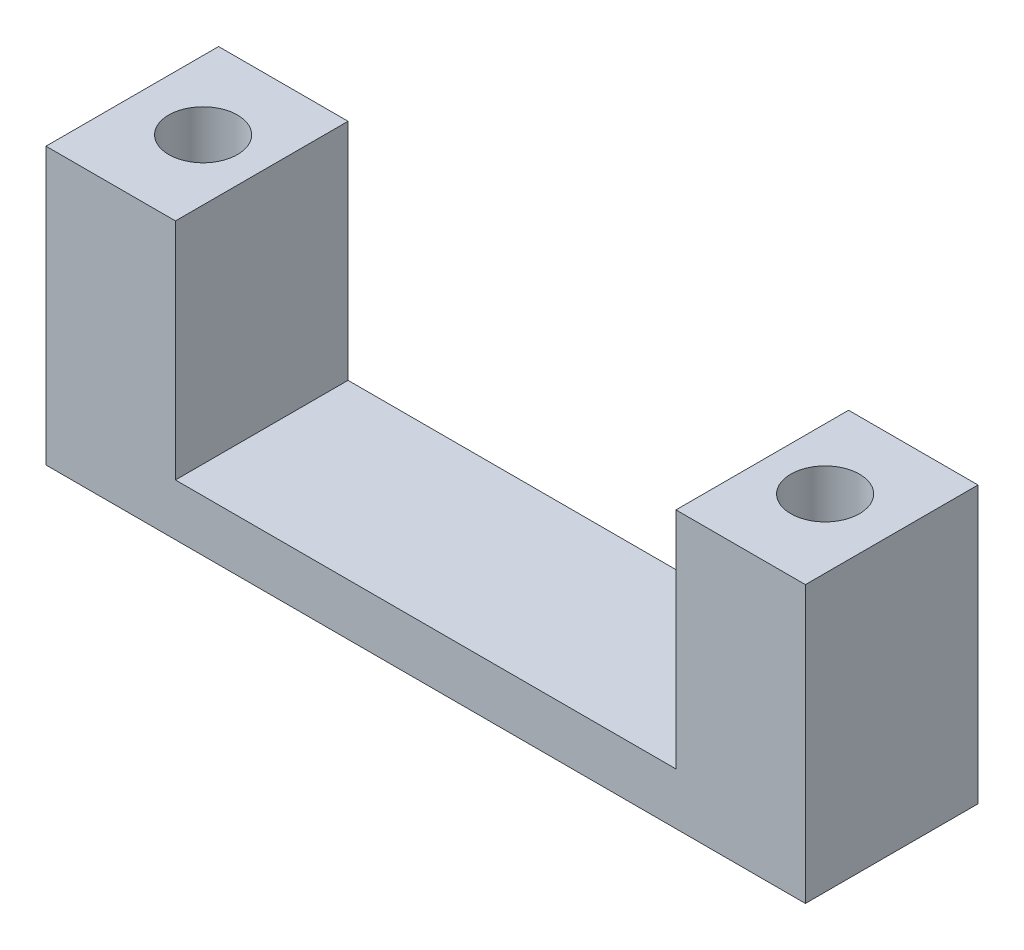
ISO-10303-21;
HEADER;
FILE_DESCRIPTION(('STEP AP214'),'2;1');
FILE_NAME('part.step','',(''),(''),'','','');
FILE_SCHEMA(('AUTOMOTIVE_DESIGN { 1 0 10303 214 1 1 1 1 }'));
ENDSEC;
DATA;
#1=APPLICATION_CONTEXT('core data for automotive mechanical design processes');
#2=APPLICATION_PROTOCOL_DEFINITION('international standard','automotive_design',2000,#1);
#3=PRODUCT_CONTEXT('',#1,'mechanical');
#4=PRODUCT('Part','Part','',(#3));
#5=PRODUCT_RELATED_PRODUCT_CATEGORY('part','',(#4));
#6=PRODUCT_DEFINITION_FORMATION('','',#4);
#7=PRODUCT_DEFINITION_CONTEXT('part definition',#1,'design');
#8=PRODUCT_DEFINITION('design','',#6,#7);
#9=PRODUCT_DEFINITION_SHAPE('','',#8);
#10=(LENGTH_UNIT() NAMED_UNIT(*) SI_UNIT(.MILLI.,.METRE.));
#11=(NAMED_UNIT(*) PLANE_ANGLE_UNIT() SI_UNIT($,.RADIAN.));
#12=(NAMED_UNIT(*) SI_UNIT($,.STERADIAN.) SOLID_ANGLE_UNIT());
#13=UNCERTAINTY_MEASURE_WITH_UNIT(LENGTH_MEASURE(1.E-05),#10,'distance_accuracy_value','');
#14=(GEOMETRIC_REPRESENTATION_CONTEXT(3) GLOBAL_UNCERTAINTY_ASSIGNED_CONTEXT((#13)) GLOBAL_UNIT_ASSIGNED_CONTEXT((#10,
#11,#12)) REPRESENTATION_CONTEXT('',''));
#15=CARTESIAN_POINT('',(0.,0.,0.));
#16=DIRECTION('',(0.,0.,1.));
#17=DIRECTION('',(1.,0.,0.));
#18=AXIS2_PLACEMENT_3D('',#15,#16,#17);
#19=CARTESIAN_POINT('',(0.,3.81,0.));
#20=DIRECTION('',(0.,1.,0.));
#21=DIRECTION('',(0.,0.,1.));
#22=AXIS2_PLACEMENT_3D('',#19,#20,#21);
#23=PLANE('',#22);
#24=DIRECTION('',(1.,0.,0.));
#25=VECTOR('',#24,1.);
#26=CARTESIAN_POINT('',(0.,3.81,0.));
#27=LINE('',#26,#25);
#28=CARTESIAN_POINT('',(-46.355,3.81,0.));
#29=VERTEX_POINT('',#28);
#30=CARTESIAN_POINT('',(-9.52500000000001,3.81,0.));
#31=VERTEX_POINT('',#30);
#32=EDGE_CURVE('E63',#29,#31,#27,.T.);
#33=ORIENTED_EDGE('',*,*,#32,.T.);
#34=DIRECTION('',(0.,0.,1.));
#35=VECTOR('',#34,1.);
#36=CARTESIAN_POINT('',(-9.52500000000001,3.81,-12.7));
#37=LINE('',#36,#35);
#38=CARTESIAN_POINT('',(-9.52500000000001,3.81,-12.7));
#39=VERTEX_POINT('',#38);
#40=EDGE_CURVE('E58',#39,#31,#37,.T.);
#41=ORIENTED_EDGE('',*,*,#40,.F.);
#42=DIRECTION('',(-1.,0.,0.));
#43=VECTOR('',#42,1.);
#44=CARTESIAN_POINT('',(0.,3.81,-12.7));
#45=LINE('',#44,#43);
#46=CARTESIAN_POINT('',(-46.355,3.81,-12.7));
#47=VERTEX_POINT('',#46);
#48=EDGE_CURVE('E186',#39,#47,#45,.T.);
#49=ORIENTED_EDGE('',*,*,#48,.T.);
#50=DIRECTION('',(0.,0.,-1.));
#51=VECTOR('',#50,1.);
#52=CARTESIAN_POINT('',(-46.355,3.81,-12.7));
#53=LINE('',#52,#51);
#54=EDGE_CURVE('E146',#29,#47,#53,.T.);
#55=ORIENTED_EDGE('',*,*,#54,.F.);
#56=EDGE_LOOP('',(#33,#41,#49,#55));
#57=FACE_BOUND('',#56,.T.);
#58=ADVANCED_FACE('F42',(#57),#23,.T.);
#59=CARTESIAN_POINT('',(0.,3.81,0.));
#60=DIRECTION('',(-1.,0.,0.));
#61=DIRECTION('',(0.,0.,1.));
#62=AXIS2_PLACEMENT_3D('',#59,#60,#61);
#63=PLANE('',#62);
#64=DIRECTION('',(0.,0.,-1.));
#65=VECTOR('',#64,1.);
#66=CARTESIAN_POINT('',(0.,0.,0.));
#67=LINE('',#66,#65);
#68=CARTESIAN_POINT('',(0.,0.,0.));
#69=VERTEX_POINT('',#68);
#70=CARTESIAN_POINT('',(0.,0.,-12.7));
#71=VERTEX_POINT('',#70);
#72=EDGE_CURVE('E185',#69,#71,#67,.T.);
#73=ORIENTED_EDGE('',*,*,#72,.T.);
#74=DIRECTION('',(0.,-1.,0.));
#75=VECTOR('',#74,1.);
#76=CARTESIAN_POINT('',(0.,3.81,-12.7));
#77=LINE('',#76,#75);
#78=CARTESIAN_POINT('',(0.,20.32,-12.7));
#79=VERTEX_POINT('',#78);
#80=EDGE_CURVE('E11',#79,#71,#77,.T.);
#81=ORIENTED_EDGE('',*,*,#80,.F.);
#82=DIRECTION('',(0.,0.,-1.));
#83=VECTOR('',#82,1.);
#84=CARTESIAN_POINT('',(0.,20.32,-12.7));
#85=LINE('',#84,#83);
#86=CARTESIAN_POINT('',(0.,20.32,0.));
#87=VERTEX_POINT('',#86);
#88=EDGE_CURVE('E147',#87,#79,#85,.T.);
#89=ORIENTED_EDGE('',*,*,#88,.F.);
#90=DIRECTION('',(0.,-1.,0.));
#91=VECTOR('',#90,1.);
#92=CARTESIAN_POINT('',(0.,3.81,0.));
#93=LINE('',#92,#91);
#94=EDGE_CURVE('E192',#87,#69,#93,.T.);
#95=ORIENTED_EDGE('',*,*,#94,.T.);
#96=EDGE_LOOP('',(#73,#81,#89,#95));
#97=FACE_BOUND('',#96,.T.);
#98=ADVANCED_FACE('F44',(#97),#63,.F.);
#99=CARTESIAN_POINT('',(0.,3.81,-12.7));
#100=DIRECTION('',(0.,0.,1.));
#101=DIRECTION('',(1.,0.,0.));
#102=AXIS2_PLACEMENT_3D('',#99,#100,#101);
#103=PLANE('',#102);
#104=DIRECTION('',(-1.,0.,0.));
#105=VECTOR('',#104,1.);
#106=CARTESIAN_POINT('',(0.,0.,-12.7));
#107=LINE('',#106,#105);
#108=CARTESIAN_POINT('',(-55.88,0.,-12.7));
#109=VERTEX_POINT('',#108);
#110=EDGE_CURVE('E196',#71,#109,#107,.T.);
#111=ORIENTED_EDGE('',*,*,#110,.T.);
#112=DIRECTION('',(0.,-1.,0.));
#113=VECTOR('',#112,1.);
#114=CARTESIAN_POINT('',(-55.88,3.81,-12.7));
#115=LINE('',#114,#113);
#116=CARTESIAN_POINT('',(-55.88,20.32,-12.7));
#117=VERTEX_POINT('',#116);
#118=EDGE_CURVE('E51',#117,#109,#115,.T.);
#119=ORIENTED_EDGE('',*,*,#118,.F.);
#120=DIRECTION('',(-1.,0.,0.));
#121=VECTOR('',#120,1.);
#122=CARTESIAN_POINT('',(-55.88,20.32,-12.7));
#123=LINE('',#122,#121);
#124=CARTESIAN_POINT('',(-46.355,20.32,-12.7));
#125=VERTEX_POINT('',#124);
#126=EDGE_CURVE('E170',#125,#117,#123,.T.);
#127=ORIENTED_EDGE('',*,*,#126,.F.);
#128=DIRECTION('',(0.,-1.,0.));
#129=VECTOR('',#128,1.);
#130=CARTESIAN_POINT('',(-46.355,20.32,-12.7));
#131=LINE('',#130,#129);
#132=EDGE_CURVE('E174',#125,#47,#131,.T.);
#133=ORIENTED_EDGE('',*,*,#132,.T.);
#134=ORIENTED_EDGE('',*,*,#48,.F.);
#135=DIRECTION('',(0.,-1.,0.));
#136=VECTOR('',#135,1.);
#137=CARTESIAN_POINT('',(-9.52500000000001,20.32,-12.7));
#138=LINE('',#137,#136);
#139=CARTESIAN_POINT('',(-9.52500000000001,20.32,-12.7));
#140=VERTEX_POINT('',#139);
#141=EDGE_CURVE('E135',#140,#39,#138,.T.);
#142=ORIENTED_EDGE('',*,*,#141,.F.);
#143=DIRECTION('',(-1.,0.,0.));
#144=VECTOR('',#143,1.);
#145=CARTESIAN_POINT('',(0.,20.32,-12.7));
#146=LINE('',#145,#144);
#147=EDGE_CURVE('E154',#79,#140,#146,.T.);
#148=ORIENTED_EDGE('',*,*,#147,.F.);
#149=ORIENTED_EDGE('',*,*,#80,.T.);
#150=EDGE_LOOP('',(#111,#119,#127,#133,#134,#142,#148,#149));
#151=FACE_BOUND('',#150,.T.);
#152=ADVANCED_FACE('F237',(#151),#103,.F.);
#153=CARTESIAN_POINT('',(-55.88,3.81,0.));
#154=DIRECTION('',(1.,0.,0.));
#155=DIRECTION('',(0.,0.,-1.));
#156=AXIS2_PLACEMENT_3D('',#153,#154,#155);
#157=PLANE('',#156);
#158=DIRECTION('',(0.,0.,1.));
#159=VECTOR('',#158,1.);
#160=CARTESIAN_POINT('',(-55.88,0.,0.));
#161=LINE('',#160,#159);
#162=CARTESIAN_POINT('',(-55.88,0.,0.));
#163=VERTEX_POINT('',#162);
#164=EDGE_CURVE('E199',#109,#163,#161,.T.);
#165=ORIENTED_EDGE('',*,*,#164,.T.);
#166=DIRECTION('',(0.,-1.,0.));
#167=VECTOR('',#166,1.);
#168=CARTESIAN_POINT('',(-55.88,3.81,0.));
#169=LINE('',#168,#167);
#170=CARTESIAN_POINT('',(-55.88,20.32,0.));
#171=VERTEX_POINT('',#170);
#172=EDGE_CURVE('E207',#171,#163,#169,.T.);
#173=ORIENTED_EDGE('',*,*,#172,.F.);
#174=DIRECTION('',(0.,0.,1.));
#175=VECTOR('',#174,1.);
#176=CARTESIAN_POINT('',(-55.88,20.32,-12.7));
#177=LINE('',#176,#175);
#178=EDGE_CURVE('E160',#117,#171,#177,.T.);
#179=ORIENTED_EDGE('',*,*,#178,.F.);
#180=ORIENTED_EDGE('',*,*,#118,.T.);
#181=EDGE_LOOP('',(#165,#173,#179,#180));
#182=FACE_BOUND('',#181,.T.);
#183=ADVANCED_FACE('F215',(#182),#157,.F.);
#184=CARTESIAN_POINT('',(0.,3.81,0.));
#185=DIRECTION('',(0.,0.,-1.));
#186=DIRECTION('',(-1.,0.,0.));
#187=AXIS2_PLACEMENT_3D('',#184,#185,#186);
#188=PLANE('',#187);
#189=DIRECTION('',(1.,0.,0.));
#190=VECTOR('',#189,1.);
#191=CARTESIAN_POINT('',(0.,0.,0.));
#192=LINE('',#191,#190);
#193=EDGE_CURVE('E189',#163,#69,#192,.T.);
#194=ORIENTED_EDGE('',*,*,#193,.T.);
#195=ORIENTED_EDGE('',*,*,#94,.F.);
#196=DIRECTION('',(1.,0.,0.));
#197=VECTOR('',#196,1.);
#198=CARTESIAN_POINT('',(0.,20.32,0.));
#199=LINE('',#198,#197);
#200=CARTESIAN_POINT('',(-9.52500000000001,20.32,0.));
#201=VERTEX_POINT('',#200);
#202=EDGE_CURVE('E143',#201,#87,#199,.T.);
#203=ORIENTED_EDGE('',*,*,#202,.F.);
#204=DIRECTION('',(0.,-1.,0.));
#205=VECTOR('',#204,1.);
#206=CARTESIAN_POINT('',(-9.52500000000001,20.32,0.));
#207=LINE('',#206,#205);
#208=EDGE_CURVE('E139',#201,#31,#207,.T.);
#209=ORIENTED_EDGE('',*,*,#208,.T.);
#210=ORIENTED_EDGE('',*,*,#32,.F.);
#211=DIRECTION('',(0.,-1.,0.));
#212=VECTOR('',#211,1.);
#213=CARTESIAN_POINT('',(-46.355,20.32,0.));
#214=LINE('',#213,#212);
#215=CARTESIAN_POINT('',(-46.355,20.32,0.));
#216=VERTEX_POINT('',#215);
#217=EDGE_CURVE('E181',#216,#29,#214,.T.);
#218=ORIENTED_EDGE('',*,*,#217,.F.);
#219=DIRECTION('',(1.,0.,0.));
#220=VECTOR('',#219,1.);
#221=CARTESIAN_POINT('',(-55.88,20.32,0.));
#222=LINE('',#221,#220);
#223=EDGE_CURVE('E164',#171,#216,#222,.T.);
#224=ORIENTED_EDGE('',*,*,#223,.F.);
#225=ORIENTED_EDGE('',*,*,#172,.T.);
#226=EDGE_LOOP('',(#194,#195,#203,#209,#210,#218,#224,#225));
#227=FACE_BOUND('',#226,.T.);
#228=ADVANCED_FACE('F223',(#227),#188,.F.);
#229=CARTESIAN_POINT('',(0.,0.,0.));
#230=DIRECTION('',(0.,1.,0.));
#231=DIRECTION('',(0.,0.,1.));
#232=AXIS2_PLACEMENT_3D('',#229,#230,#231);
#233=PLANE('',#232);
#234=ORIENTED_EDGE('',*,*,#72,.F.);
#235=ORIENTED_EDGE('',*,*,#193,.F.);
#236=ORIENTED_EDGE('',*,*,#164,.F.);
#237=ORIENTED_EDGE('',*,*,#110,.F.);
#238=EDGE_LOOP('',(#234,#235,#236,#237));
#239=FACE_BOUND('',#238,.T.);
#240=ADVANCED_FACE('F221',(#239),#233,.F.);
#241=CARTESIAN_POINT('',(-46.355,20.32,-12.7));
#242=DIRECTION('',(-1.,0.,0.));
#243=DIRECTION('',(0.,0.,1.));
#244=AXIS2_PLACEMENT_3D('',#241,#242,#243);
#245=PLANE('',#244);
#246=ORIENTED_EDGE('',*,*,#54,.T.);
#247=ORIENTED_EDGE('',*,*,#132,.F.);
#248=DIRECTION('',(0.,0.,-1.));
#249=VECTOR('',#248,1.);
#250=CARTESIAN_POINT('',(-46.355,20.32,-12.7));
#251=LINE('',#250,#249);
#252=EDGE_CURVE('E167',#216,#125,#251,.T.);
#253=ORIENTED_EDGE('',*,*,#252,.F.);
#254=ORIENTED_EDGE('',*,*,#217,.T.);
#255=EDGE_LOOP('',(#246,#247,#253,#254));
#256=FACE_BOUND('',#255,.T.);
#257=ADVANCED_FACE('F240',(#256),#245,.F.);
#258=CARTESIAN_POINT('',(0.,20.32,0.));
#259=DIRECTION('',(0.,1.,0.));
#260=DIRECTION('',(0.,0.,1.));
#261=AXIS2_PLACEMENT_3D('',#258,#259,#260);
#262=PLANE('',#261);
#263=CARTESIAN_POINT('',(-50.8254,20.32,-6.50524861641984));
#264=DIRECTION('',(0.,1.,0.));
#265=DIRECTION('',(0.,0.,1.));
#266=AXIS2_PLACEMENT_3D('',#263,#264,#265);
#267=CIRCLE('',#266,2.52729999999999);
#268=CARTESIAN_POINT('',(-50.8254,20.32,-3.97794861641985));
#269=VERTEX_POINT('',#268);
#270=EDGE_CURVE('E122',#269,#269,#267,.T.);
#271=ORIENTED_EDGE('',*,*,#270,.F.);
#272=EDGE_LOOP('',(#271));
#273=FACE_BOUND('',#272,.T.);
#274=ORIENTED_EDGE('',*,*,#178,.T.);
#275=ORIENTED_EDGE('',*,*,#223,.T.);
#276=ORIENTED_EDGE('',*,*,#252,.T.);
#277=ORIENTED_EDGE('',*,*,#126,.T.);
#278=EDGE_LOOP('',(#274,#275,#276,#277));
#279=FACE_BOUND('',#278,.T.);
#280=ADVANCED_FACE('F243',(#273,#279),#262,.T.);
#281=CARTESIAN_POINT('',(-9.52500000000001,20.32,-12.7));
#282=DIRECTION('',(1.,0.,0.));
#283=DIRECTION('',(0.,0.,-1.));
#284=AXIS2_PLACEMENT_3D('',#281,#282,#283);
#285=PLANE('',#284);
#286=ORIENTED_EDGE('',*,*,#40,.T.);
#287=ORIENTED_EDGE('',*,*,#208,.F.);
#288=DIRECTION('',(0.,0.,1.));
#289=VECTOR('',#288,1.);
#290=CARTESIAN_POINT('',(-9.52500000000001,20.32,-12.7));
#291=LINE('',#290,#289);
#292=EDGE_CURVE('E151',#140,#201,#291,.T.);
#293=ORIENTED_EDGE('',*,*,#292,.F.);
#294=ORIENTED_EDGE('',*,*,#141,.T.);
#295=EDGE_LOOP('',(#286,#287,#293,#294));
#296=FACE_BOUND('',#295,.T.);
#297=ADVANCED_FACE('F236',(#296),#285,.F.);
#298=CARTESIAN_POINT('',(0.,20.32,0.));
#299=DIRECTION('',(0.,-1.,0.));
#300=DIRECTION('',(0.,0.,-1.));
#301=AXIS2_PLACEMENT_3D('',#298,#299,#300);
#302=PLANE('',#301);
#303=CARTESIAN_POINT('',(-5.05460000000001,20.32,-6.50524861641984));
#304=DIRECTION('',(0.,1.,0.));
#305=DIRECTION('',(0.,0.,1.));
#306=AXIS2_PLACEMENT_3D('',#303,#304,#305);
#307=CIRCLE('',#306,2.52729999999999);
#308=CARTESIAN_POINT('',(-5.05460000000001,20.32,-3.97794861641985));
#309=VERTEX_POINT('',#308);
#310=EDGE_CURVE('E121',#309,#309,#307,.T.);
#311=ORIENTED_EDGE('',*,*,#310,.F.);
#312=EDGE_LOOP('',(#311));
#313=FACE_BOUND('',#312,.T.);
#314=ORIENTED_EDGE('',*,*,#88,.T.);
#315=ORIENTED_EDGE('',*,*,#147,.T.);
#316=ORIENTED_EDGE('',*,*,#292,.T.);
#317=ORIENTED_EDGE('',*,*,#202,.T.);
#318=EDGE_LOOP('',(#314,#315,#316,#317));
#319=FACE_BOUND('',#318,.T.);
#320=ADVANCED_FACE('F230',(#313,#319),#302,.F.);
#321=CARTESIAN_POINT('',(-5.05460000000001,13.208,-6.50524861641984));
#322=DIRECTION('',(0.,1.,0.));
#323=DIRECTION('',(0.,0.,1.));
#324=AXIS2_PLACEMENT_3D('',#321,#322,#323);
#325=CONICAL_SURFACE('',#324,2.5273,1.02974425867665);
#326=CARTESIAN_POINT('',(-5.05460000000001,11.6894449575316,-6.50524861641984));
#327=VERTEX_POINT('',#326);
#328=VERTEX_LOOP('',#327);
#329=FACE_BOUND('',#328,.T.);
#330=CARTESIAN_POINT('',(-5.05460000000001,13.208,-6.50524861641984));
#331=DIRECTION('',(0.,1.,0.));
#332=DIRECTION('',(0.,0.,1.));
#333=AXIS2_PLACEMENT_3D('',#330,#331,#332);
#334=CIRCLE('',#333,2.5273);
#335=CARTESIAN_POINT('',(-5.05460000000001,13.208,-3.97794861641984));
#336=VERTEX_POINT('',#335);
#337=EDGE_CURVE('E127',#336,#336,#334,.T.);
#338=ORIENTED_EDGE('',*,*,#337,.T.);
#339=EDGE_LOOP('',(#338));
#340=FACE_BOUND('',#339,.T.);
#341=ADVANCED_FACE('F309',(#329,#340),#325,.F.);
#342=CARTESIAN_POINT('',(-5.05460000000001,20.32,-6.50524861641984));
#343=DIRECTION('',(0.,1.,0.));
#344=DIRECTION('',(0.,0.,1.));
#345=AXIS2_PLACEMENT_3D('',#342,#343,#344);
#346=CYLINDRICAL_SURFACE('',#345,2.52729999999999);
#347=ORIENTED_EDGE('',*,*,#337,.F.);
#348=EDGE_LOOP('',(#347));
#349=FACE_BOUND('',#348,.T.);
#350=ORIENTED_EDGE('',*,*,#310,.T.);
#351=EDGE_LOOP('',(#350));
#352=FACE_BOUND('',#351,.T.);
#353=ADVANCED_FACE('F114',(#349,#352),#346,.F.);
#354=CARTESIAN_POINT('',(-50.8254,13.208,-6.50524861641984));
#355=DIRECTION('',(0.,1.,0.));
#356=DIRECTION('',(0.,0.,1.));
#357=AXIS2_PLACEMENT_3D('',#354,#355,#356);
#358=CONICAL_SURFACE('',#357,2.5273,1.02974425867665);
#359=CARTESIAN_POINT('',(-50.8254,11.6894449575316,-6.50524861641984));
#360=VERTEX_POINT('',#359);
#361=VERTEX_LOOP('',#360);
#362=FACE_BOUND('',#361,.T.);
#363=CARTESIAN_POINT('',(-50.8254,13.208,-6.50524861641984));
#364=DIRECTION('',(0.,1.,0.));
#365=DIRECTION('',(0.,0.,1.));
#366=AXIS2_PLACEMENT_3D('',#363,#364,#365);
#367=CIRCLE('',#366,2.5273);
#368=CARTESIAN_POINT('',(-50.8254,13.208,-3.97794861641984));
#369=VERTEX_POINT('',#368);
#370=EDGE_CURVE('E118',#369,#369,#367,.T.);
#371=ORIENTED_EDGE('',*,*,#370,.T.);
#372=EDGE_LOOP('',(#371));
#373=FACE_BOUND('',#372,.T.);
#374=ADVANCED_FACE('F110',(#362,#373),#358,.F.);
#375=CARTESIAN_POINT('',(-50.8254,20.32,-6.50524861641984));
#376=DIRECTION('',(0.,1.,0.));
#377=DIRECTION('',(0.,0.,1.));
#378=AXIS2_PLACEMENT_3D('',#375,#376,#377);
#379=CYLINDRICAL_SURFACE('',#378,2.52729999999999);
#380=ORIENTED_EDGE('',*,*,#370,.F.);
#381=EDGE_LOOP('',(#380));
#382=FACE_BOUND('',#381,.T.);
#383=ORIENTED_EDGE('',*,*,#270,.T.);
#384=EDGE_LOOP('',(#383));
#385=FACE_BOUND('',#384,.T.);
#386=ADVANCED_FACE('F113',(#382,#385),#379,.F.);
#387=CLOSED_SHELL('',(#58,#98,#152,#183,#228,#240,#257,#280,#297,#320,#341,#353,#374,#386));
#388=MANIFOLD_SOLID_BREP('B2',#387);
#389=ADVANCED_BREP_SHAPE_REPRESENTATION('',(#18,#388),#14);
#390=SHAPE_DEFINITION_REPRESENTATION(#9,#389);
ENDSEC;
END-ISO-10303-21;
